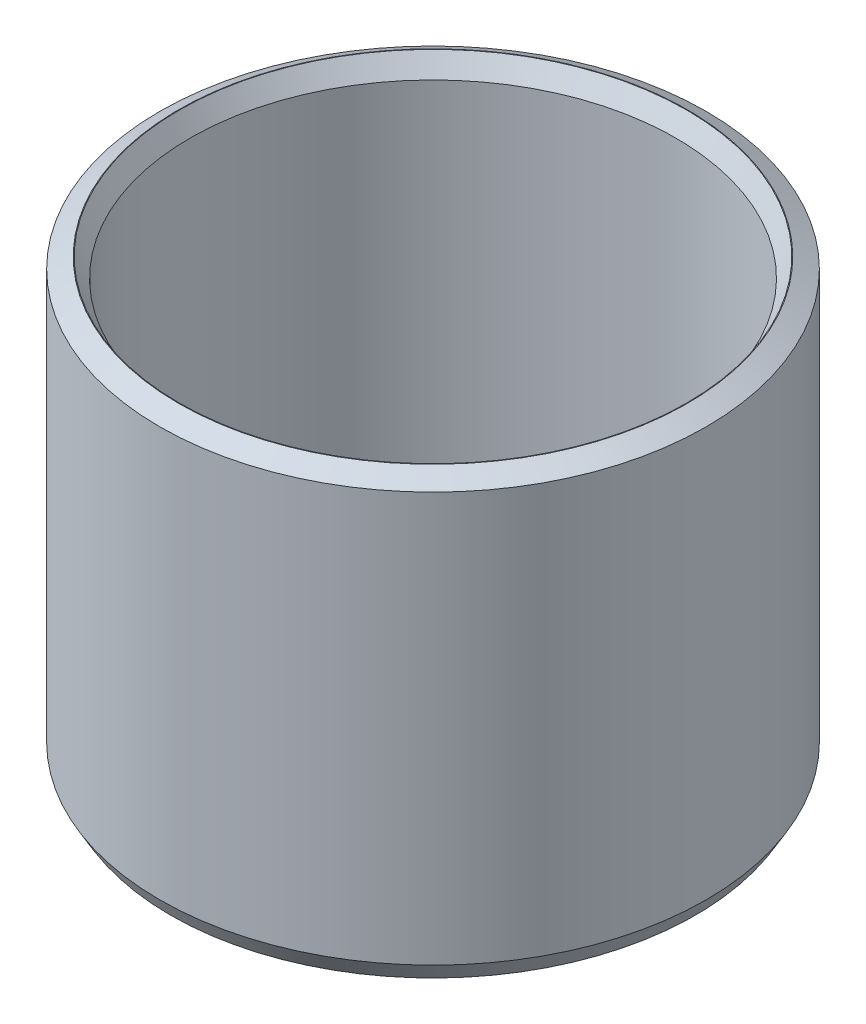
ISO-10303-21;
HEADER;
FILE_DESCRIPTION(('STEP AP214'),'2;1');
FILE_NAME('part.step','',(''),(''),'','','');
FILE_SCHEMA(('AUTOMOTIVE_DESIGN { 1 0 10303 214 1 1 1 1 }'));
ENDSEC;
DATA;
#1=APPLICATION_CONTEXT('core data for automotive mechanical design processes');
#2=APPLICATION_PROTOCOL_DEFINITION('international standard','automotive_design',2000,#1);
#3=PRODUCT_CONTEXT('',#1,'mechanical');
#4=PRODUCT('Part','Part','',(#3));
#5=PRODUCT_RELATED_PRODUCT_CATEGORY('part','',(#4));
#6=PRODUCT_DEFINITION_FORMATION('','',#4);
#7=PRODUCT_DEFINITION_CONTEXT('part definition',#1,'design');
#8=PRODUCT_DEFINITION('design','',#6,#7);
#9=PRODUCT_DEFINITION_SHAPE('','',#8);
#10=(LENGTH_UNIT() NAMED_UNIT(*) SI_UNIT(.MILLI.,.METRE.));
#11=(NAMED_UNIT(*) PLANE_ANGLE_UNIT() SI_UNIT($,.RADIAN.));
#12=(NAMED_UNIT(*) SI_UNIT($,.STERADIAN.) SOLID_ANGLE_UNIT());
#13=UNCERTAINTY_MEASURE_WITH_UNIT(LENGTH_MEASURE(1.E-05),#10,'distance_accuracy_value','');
#14=(GEOMETRIC_REPRESENTATION_CONTEXT(3) GLOBAL_UNCERTAINTY_ASSIGNED_CONTEXT((#13)) GLOBAL_UNIT_ASSIGNED_CONTEXT((#10,
#11,#12)) REPRESENTATION_CONTEXT('',''));
#15=CARTESIAN_POINT('',(0.,0.,0.));
#16=DIRECTION('',(0.,0.,1.));
#17=DIRECTION('',(1.,0.,0.));
#18=AXIS2_PLACEMENT_3D('',#15,#16,#17);
#19=CARTESIAN_POINT('',(0.,64.3183423877962,0.));
#20=DIRECTION('',(0.,-1.,0.));
#21=DIRECTION('',(0.,0.,-1.));
#22=AXIS2_PLACEMENT_3D('',#19,#20,#21);
#23=CYLINDRICAL_SURFACE('',#22,40.);
#24=CARTESIAN_POINT('',(0.,2.75293287427572,0.));
#25=DIRECTION('',(0.,1.,0.));
#26=DIRECTION('',(0.,0.,1.));
#27=AXIS2_PLACEMENT_3D('',#24,#25,#26);
#28=CIRCLE('',#27,40.);
#29=CARTESIAN_POINT('',(0.,2.75293287427572,40.));
#30=VERTEX_POINT('',#29);
#31=EDGE_CURVE('E10',#30,#30,#28,.T.);
#32=ORIENTED_EDGE('',*,*,#31,.T.);
#33=EDGE_LOOP('',(#32));
#34=FACE_BOUND('',#33,.T.);
#35=CARTESIAN_POINT('',(0.,62.7289358517721,0.));
#36=DIRECTION('',(0.,1.,0.));
#37=DIRECTION('',(0.,0.,1.));
#38=AXIS2_PLACEMENT_3D('',#35,#36,#37);
#39=CIRCLE('',#38,40.);
#40=CARTESIAN_POINT('',(0.,62.7289358517721,40.));
#41=VERTEX_POINT('',#40);
#42=EDGE_CURVE('E50',#41,#41,#39,.F.);
#43=ORIENTED_EDGE('',*,*,#42,.T.);
#44=EDGE_LOOP('',(#43));
#45=FACE_BOUND('',#44,.T.);
#46=ADVANCED_FACE('F39',(#34,#45),#23,.T.);
#47=CARTESIAN_POINT('',(0.,64.3183423877962,0.));
#48=DIRECTION('',(0.,1.,0.));
#49=DIRECTION('',(0.,0.,1.));
#50=AXIS2_PLACEMENT_3D('',#47,#48,#49);
#51=PLANE('',#50);
#52=CARTESIAN_POINT('',(0.,64.3183423877962,0.));
#53=DIRECTION('',(0.,1.,0.));
#54=DIRECTION('',(0.,0.,1.));
#55=AXIS2_PLACEMENT_3D('',#52,#53,#54);
#56=CIRCLE('',#55,37.1482703339727);
#57=CARTESIAN_POINT('',(0.,64.3183423877962,37.1482703339727));
#58=VERTEX_POINT('',#57);
#59=EDGE_CURVE('E58',#58,#58,#56,.F.);
#60=ORIENTED_EDGE('',*,*,#59,.T.);
#61=EDGE_LOOP('',(#60));
#62=FACE_BOUND('',#61,.T.);
#63=CARTESIAN_POINT('',(0.,64.3183423877962,0.));
#64=DIRECTION('',(0.,1.,0.));
#65=DIRECTION('',(0.,0.,1.));
#66=AXIS2_PLACEMENT_3D('',#63,#64,#65);
#67=CIRCLE('',#66,37.2470671257243);
#68=CARTESIAN_POINT('',(0.,64.3183423877962,37.2470671257243));
#69=VERTEX_POINT('',#68);
#70=EDGE_CURVE('E61',#69,#69,#67,.T.);
#71=ORIENTED_EDGE('',*,*,#70,.T.);
#72=EDGE_LOOP('',(#71));
#73=FACE_BOUND('',#72,.T.);
#74=ADVANCED_FACE('F88',(#62,#73),#51,.T.);
#75=CARTESIAN_POINT('',(0.,0.,0.));
#76=DIRECTION('',(0.,1.,0.));
#77=DIRECTION('',(0.,0.,1.));
#78=AXIS2_PLACEMENT_3D('',#75,#76,#77);
#79=PLANE('',#78);
#80=CARTESIAN_POINT('',(0.,0.,0.));
#81=DIRECTION('',(0.,1.,0.));
#82=DIRECTION('',(0.,0.,1.));
#83=AXIS2_PLACEMENT_3D('',#80,#81,#82);
#84=CIRCLE('',#83,38.3117966722243);
#85=CARTESIAN_POINT('',(0.,0.,38.3117966722243));
#86=VERTEX_POINT('',#85);
#87=EDGE_CURVE('E51',#86,#86,#84,.T.);
#88=ORIENTED_EDGE('',*,*,#87,.T.);
#89=EDGE_LOOP('',(#88));
#90=FACE_BOUND('',#89,.T.);
#91=CARTESIAN_POINT('',(0.,0.,0.));
#92=DIRECTION('',(0.,1.,0.));
#93=DIRECTION('',(0.,0.,1.));
#94=AXIS2_PLACEMENT_3D('',#91,#92,#93);
#95=CIRCLE('',#94,38.4105934639759);
#96=CARTESIAN_POINT('',(0.,0.,38.4105934639759));
#97=VERTEX_POINT('',#96);
#98=EDGE_CURVE('E54',#97,#97,#95,.F.);
#99=ORIENTED_EDGE('',*,*,#98,.T.);
#100=EDGE_LOOP('',(#99));
#101=FACE_BOUND('',#100,.T.);
#102=ADVANCED_FACE('F83',(#90,#101),#79,.F.);
#103=CARTESIAN_POINT('',(0.,64.3183423877962,0.));
#104=DIRECTION('',(0.,-1.,0.));
#105=DIRECTION('',(0.,0.,-1.));
#106=AXIS2_PLACEMENT_3D('',#103,#104,#105);
#107=CYLINDRICAL_SURFACE('',#106,35.5588637979486);
#108=CARTESIAN_POINT('',(0.,61.5654095135205,0.));
#109=DIRECTION('',(0.,1.,0.));
#110=DIRECTION('',(0.,0.,1.));
#111=AXIS2_PLACEMENT_3D('',#108,#109,#110);
#112=CIRCLE('',#111,35.5588637979486);
#113=CARTESIAN_POINT('',(0.,61.5654095135205,35.5588637979486));
#114=VERTEX_POINT('',#113);
#115=EDGE_CURVE('E67',#114,#114,#112,.T.);
#116=ORIENTED_EDGE('',*,*,#115,.T.);
#117=EDGE_LOOP('',(#116));
#118=FACE_BOUND('',#117,.T.);
#119=CARTESIAN_POINT('',(0.,1.58940653602406,0.));
#120=DIRECTION('',(0.,1.,0.));
#121=DIRECTION('',(0.,0.,1.));
#122=AXIS2_PLACEMENT_3D('',#119,#120,#121);
#123=CIRCLE('',#122,35.5588637979486);
#124=CARTESIAN_POINT('',(0.,1.58940653602406,35.5588637979486));
#125=VERTEX_POINT('',#124);
#126=EDGE_CURVE('E69',#125,#125,#123,.F.);
#127=ORIENTED_EDGE('',*,*,#126,.T.);
#128=EDGE_LOOP('',(#127));
#129=FACE_BOUND('',#128,.T.);
#130=ADVANCED_FACE('F71',(#118,#129),#107,.F.);
#131=CARTESIAN_POINT('',(0.,61.5654095135205,0.));
#132=DIRECTION('',(0.,1.,0.));
#133=DIRECTION('',(0.,0.,1.));
#134=AXIS2_PLACEMENT_3D('',#131,#132,#133);
#135=CONICAL_SURFACE('',#134,35.5588637979486,0.523598775598302);
#136=ORIENTED_EDGE('',*,*,#59,.F.);
#137=EDGE_LOOP('',(#136));
#138=FACE_BOUND('',#137,.T.);
#139=ORIENTED_EDGE('',*,*,#115,.F.);
#140=EDGE_LOOP('',(#139));
#141=FACE_BOUND('',#140,.T.);
#142=ADVANCED_FACE('F77',(#138,#141),#135,.F.);
#143=CARTESIAN_POINT('',(0.,0.,0.));
#144=DIRECTION('',(0.,-1.,0.));
#145=DIRECTION('',(0.,0.,-1.));
#146=AXIS2_PLACEMENT_3D('',#143,#144,#145);
#147=CONICAL_SURFACE('',#146,38.3117966722243,1.04719755119659);
#148=ORIENTED_EDGE('',*,*,#126,.F.);
#149=EDGE_LOOP('',(#148));
#150=FACE_BOUND('',#149,.T.);
#151=ORIENTED_EDGE('',*,*,#87,.F.);
#152=EDGE_LOOP('',(#151));
#153=FACE_BOUND('',#152,.T.);
#154=ADVANCED_FACE('F73',(#150,#153),#147,.F.);
#155=CARTESIAN_POINT('',(0.,2.75293287427572,0.));
#156=DIRECTION('',(0.,1.,0.));
#157=DIRECTION('',(0.,0.,1.));
#158=AXIS2_PLACEMENT_3D('',#155,#156,#157);
#159=CONICAL_SURFACE('',#158,40.,0.523598775598305);
#160=ORIENTED_EDGE('',*,*,#98,.F.);
#161=EDGE_LOOP('',(#160));
#162=FACE_BOUND('',#161,.T.);
#163=ORIENTED_EDGE('',*,*,#31,.F.);
#164=EDGE_LOOP('',(#163));
#165=FACE_BOUND('',#164,.T.);
#166=ADVANCED_FACE('F76',(#162,#165),#159,.T.);
#167=CARTESIAN_POINT('',(0.,64.3183423877962,0.));
#168=DIRECTION('',(0.,-1.,0.));
#169=DIRECTION('',(0.,0.,-1.));
#170=AXIS2_PLACEMENT_3D('',#167,#168,#169);
#171=CONICAL_SURFACE('',#170,37.2470671257243,1.04719755119659);
#172=ORIENTED_EDGE('',*,*,#42,.F.);
#173=EDGE_LOOP('',(#172));
#174=FACE_BOUND('',#173,.T.);
#175=ORIENTED_EDGE('',*,*,#70,.F.);
#176=EDGE_LOOP('',(#175));
#177=FACE_BOUND('',#176,.T.);
#178=ADVANCED_FACE('F45',(#174,#177),#171,.T.);
#179=CLOSED_SHELL('',(#46,#74,#102,#130,#142,#154,#166,#178));
#180=MANIFOLD_SOLID_BREP('B2',#179);
#181=ADVANCED_BREP_SHAPE_REPRESENTATION('',(#18,#180),#14);
#182=SHAPE_DEFINITION_REPRESENTATION(#9,#181);
ENDSEC;
END-ISO-10303-21;
